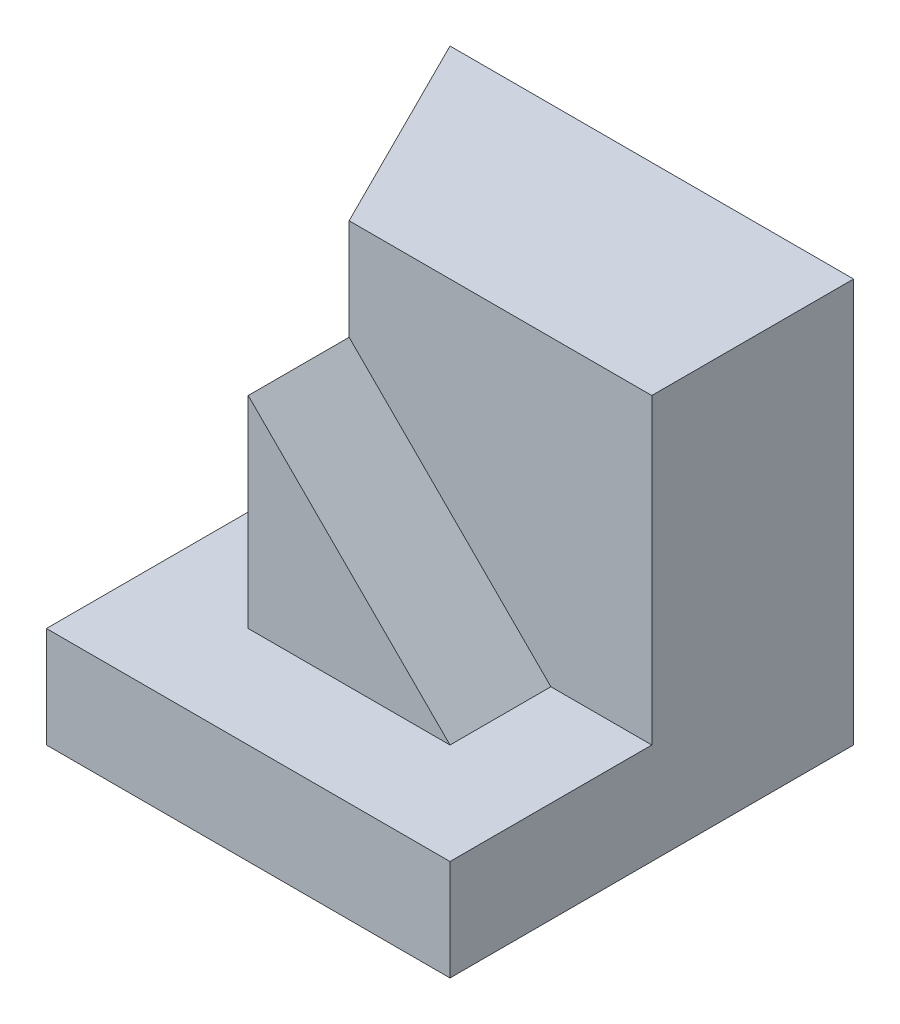
ISO-10303-21;
HEADER;
FILE_DESCRIPTION(('STEP AP214'),'2;1');
FILE_NAME('part.step','',(''),(''),'','','');
FILE_SCHEMA(('AUTOMOTIVE_DESIGN { 1 0 10303 214 1 1 1 1 }'));
ENDSEC;
DATA;
#1=APPLICATION_CONTEXT('core data for automotive mechanical design processes');
#2=APPLICATION_PROTOCOL_DEFINITION('international standard','automotive_design',2000,#1);
#3=PRODUCT_CONTEXT('',#1,'mechanical');
#4=PRODUCT('Part','Part','',(#3));
#5=PRODUCT_RELATED_PRODUCT_CATEGORY('part','',(#4));
#6=PRODUCT_DEFINITION_FORMATION('','',#4);
#7=PRODUCT_DEFINITION_CONTEXT('part definition',#1,'design');
#8=PRODUCT_DEFINITION('design','',#6,#7);
#9=PRODUCT_DEFINITION_SHAPE('','',#8);
#10=(LENGTH_UNIT() NAMED_UNIT(*) SI_UNIT(.MILLI.,.METRE.));
#11=(NAMED_UNIT(*) PLANE_ANGLE_UNIT() SI_UNIT($,.RADIAN.));
#12=(NAMED_UNIT(*) SI_UNIT($,.STERADIAN.) SOLID_ANGLE_UNIT());
#13=UNCERTAINTY_MEASURE_WITH_UNIT(LENGTH_MEASURE(1.E-05),#10,'distance_accuracy_value','');
#14=(GEOMETRIC_REPRESENTATION_CONTEXT(3) GLOBAL_UNCERTAINTY_ASSIGNED_CONTEXT((#13)) GLOBAL_UNIT_ASSIGNED_CONTEXT((#10,
#11,#12)) REPRESENTATION_CONTEXT('',''));
#15=CARTESIAN_POINT('',(0.,0.,0.));
#16=DIRECTION('',(0.,0.,1.));
#17=DIRECTION('',(1.,0.,0.));
#18=AXIS2_PLACEMENT_3D('',#15,#16,#17);
#19=CARTESIAN_POINT('',(0.,0.,40.));
#20=DIRECTION('',(1.,0.,0.));
#21=DIRECTION('',(0.,0.,-1.));
#22=AXIS2_PLACEMENT_3D('',#19,#20,#21);
#23=PLANE('',#22);
#24=DIRECTION('',(0.,0.,-1.));
#25=VECTOR('',#24,1.);
#26=CARTESIAN_POINT('',(0.,9.99999999999998,0.));
#27=LINE('',#26,#25);
#28=CARTESIAN_POINT('',(0.,10.,40.));
#29=VERTEX_POINT('',#28);
#30=CARTESIAN_POINT('',(0.,10.,0.));
#31=VERTEX_POINT('',#30);
#32=EDGE_CURVE('E47',#29,#31,#27,.T.);
#33=ORIENTED_EDGE('',*,*,#32,.T.);
#34=DIRECTION('',(0.,-1.,0.));
#35=VECTOR('',#34,1.);
#36=CARTESIAN_POINT('',(0.,0.,0.));
#37=LINE('',#36,#35);
#38=CARTESIAN_POINT('',(0.,0.,0.));
#39=VERTEX_POINT('',#38);
#40=EDGE_CURVE('E107',#31,#39,#37,.T.);
#41=ORIENTED_EDGE('',*,*,#40,.T.);
#42=DIRECTION('',(0.,0.,-1.));
#43=VECTOR('',#42,1.);
#44=CARTESIAN_POINT('',(0.,0.,40.));
#45=LINE('',#44,#43);
#46=CARTESIAN_POINT('',(0.,0.,40.));
#47=VERTEX_POINT('',#46);
#48=EDGE_CURVE('E11',#47,#39,#45,.T.);
#49=ORIENTED_EDGE('',*,*,#48,.F.);
#50=DIRECTION('',(0.,-1.,0.));
#51=VECTOR('',#50,1.);
#52=CARTESIAN_POINT('',(0.,0.,40.));
#53=LINE('',#52,#51);
#54=EDGE_CURVE('E101',#29,#47,#53,.T.);
#55=ORIENTED_EDGE('',*,*,#54,.F.);
#56=EDGE_LOOP('',(#33,#41,#49,#55));
#57=FACE_BOUND('',#56,.T.);
#58=ADVANCED_FACE('F33',(#57),#23,.F.);
#59=CARTESIAN_POINT('',(40.,0.,40.));
#60=DIRECTION('',(-1.,0.,0.));
#61=DIRECTION('',(0.,0.,1.));
#62=AXIS2_PLACEMENT_3D('',#59,#60,#61);
#63=PLANE('',#62);
#64=DIRECTION('',(0.,-1.,0.));
#65=VECTOR('',#64,1.);
#66=CARTESIAN_POINT('',(40.,0.,20.));
#67=LINE('',#66,#65);
#68=CARTESIAN_POINT('',(40.,40.,20.));
#69=VERTEX_POINT('',#68);
#70=CARTESIAN_POINT('',(40.,9.99999999999998,20.));
#71=VERTEX_POINT('',#70);
#72=EDGE_CURVE('E118',#69,#71,#67,.T.);
#73=ORIENTED_EDGE('',*,*,#72,.T.);
#74=DIRECTION('',(0.,0.,-1.));
#75=VECTOR('',#74,1.);
#76=CARTESIAN_POINT('',(40.,9.99999999999998,0.));
#77=LINE('',#76,#75);
#78=CARTESIAN_POINT('',(40.,10.,40.));
#79=VERTEX_POINT('',#78);
#80=EDGE_CURVE('E112',#79,#71,#77,.T.);
#81=ORIENTED_EDGE('',*,*,#80,.F.);
#82=DIRECTION('',(0.,1.,0.));
#83=VECTOR('',#82,1.);
#84=CARTESIAN_POINT('',(40.,0.,40.));
#85=LINE('',#84,#83);
#86=CARTESIAN_POINT('',(40.,0.,40.));
#87=VERTEX_POINT('',#86);
#88=EDGE_CURVE('E86',#87,#79,#85,.T.);
#89=ORIENTED_EDGE('',*,*,#88,.F.);
#90=DIRECTION('',(0.,0.,-1.));
#91=VECTOR('',#90,1.);
#92=CARTESIAN_POINT('',(40.,0.,40.));
#93=LINE('',#92,#91);
#94=CARTESIAN_POINT('',(40.,0.,0.));
#95=VERTEX_POINT('',#94);
#96=EDGE_CURVE('E40',#87,#95,#93,.T.);
#97=ORIENTED_EDGE('',*,*,#96,.T.);
#98=DIRECTION('',(0.,1.,0.));
#99=VECTOR('',#98,1.);
#100=CARTESIAN_POINT('',(40.,0.,0.));
#101=LINE('',#100,#99);
#102=CARTESIAN_POINT('',(40.,40.,0.));
#103=VERTEX_POINT('',#102);
#104=EDGE_CURVE('E90',#95,#103,#101,.T.);
#105=ORIENTED_EDGE('',*,*,#104,.T.);
#106=DIRECTION('',(0.,0.,-1.));
#107=VECTOR('',#106,1.);
#108=CARTESIAN_POINT('',(40.,40.,40.));
#109=LINE('',#108,#107);
#110=EDGE_CURVE('E73',#69,#103,#109,.T.);
#111=ORIENTED_EDGE('',*,*,#110,.F.);
#112=EDGE_LOOP('',(#73,#81,#89,#97,#105,#111));
#113=FACE_BOUND('',#112,.T.);
#114=ADVANCED_FACE('F91',(#113),#63,.F.);
#115=CARTESIAN_POINT('',(0.,0.,40.));
#116=DIRECTION('',(0.,0.,-1.));
#117=DIRECTION('',(-1.,0.,0.));
#118=AXIS2_PLACEMENT_3D('',#115,#116,#117);
#119=PLANE('',#118);
#120=DIRECTION('',(-1.,0.,0.));
#121=VECTOR('',#120,1.);
#122=CARTESIAN_POINT('',(40.,10.,40.));
#123=LINE('',#122,#121);
#124=EDGE_CURVE('E115',#79,#29,#123,.T.);
#125=ORIENTED_EDGE('',*,*,#124,.T.);
#126=ORIENTED_EDGE('',*,*,#54,.T.);
#127=DIRECTION('',(1.,0.,0.));
#128=VECTOR('',#127,1.);
#129=CARTESIAN_POINT('',(0.,0.,40.));
#130=LINE('',#129,#128);
#131=EDGE_CURVE('E56',#47,#87,#130,.T.);
#132=ORIENTED_EDGE('',*,*,#131,.T.);
#133=ORIENTED_EDGE('',*,*,#88,.T.);
#134=EDGE_LOOP('',(#125,#126,#132,#133));
#135=FACE_BOUND('',#134,.T.);
#136=ADVANCED_FACE('F212',(#135),#119,.F.);
#137=CARTESIAN_POINT('',(0.,0.,40.));
#138=DIRECTION('',(0.,1.,0.));
#139=DIRECTION('',(0.,0.,1.));
#140=AXIS2_PLACEMENT_3D('',#137,#138,#139);
#141=PLANE('',#140);
#142=DIRECTION('',(1.,0.,0.));
#143=VECTOR('',#142,1.);
#144=CARTESIAN_POINT('',(0.,0.,0.));
#145=LINE('',#144,#143);
#146=EDGE_CURVE('E95',#39,#95,#145,.T.);
#147=ORIENTED_EDGE('',*,*,#146,.T.);
#148=ORIENTED_EDGE('',*,*,#96,.F.);
#149=ORIENTED_EDGE('',*,*,#131,.F.);
#150=ORIENTED_EDGE('',*,*,#48,.T.);
#151=EDGE_LOOP('',(#147,#148,#149,#150));
#152=FACE_BOUND('',#151,.T.);
#153=ADVANCED_FACE('F217',(#152),#141,.F.);
#154=CARTESIAN_POINT('',(0.,40.,40.));
#155=DIRECTION('',(0.,-1.,0.));
#156=DIRECTION('',(0.,0.,-1.));
#157=AXIS2_PLACEMENT_3D('',#154,#155,#156);
#158=PLANE('',#157);
#159=DIRECTION('',(-1.,0.,0.));
#160=VECTOR('',#159,1.);
#161=CARTESIAN_POINT('',(0.,40.,0.));
#162=LINE('',#161,#160);
#163=CARTESIAN_POINT('',(0.,40.,0.));
#164=VERTEX_POINT('',#163);
#165=EDGE_CURVE('E79',#103,#164,#162,.T.);
#166=ORIENTED_EDGE('',*,*,#165,.T.);
#167=DIRECTION('',(-0.447213595499958,0.,-0.894427190999916));
#168=VECTOR('',#167,1.);
#169=CARTESIAN_POINT('',(10.,40.,20.));
#170=LINE('',#169,#168);
#171=CARTESIAN_POINT('',(10.,40.,20.));
#172=VERTEX_POINT('',#171);
#173=EDGE_CURVE('E144',#172,#164,#170,.T.);
#174=ORIENTED_EDGE('',*,*,#173,.F.);
#175=DIRECTION('',(-1.,0.,0.));
#176=VECTOR('',#175,1.);
#177=CARTESIAN_POINT('',(40.,40.,20.));
#178=LINE('',#177,#176);
#179=EDGE_CURVE('E83',#69,#172,#178,.T.);
#180=ORIENTED_EDGE('',*,*,#179,.F.);
#181=ORIENTED_EDGE('',*,*,#110,.T.);
#182=EDGE_LOOP('',(#166,#174,#180,#181));
#183=FACE_BOUND('',#182,.T.);
#184=ADVANCED_FACE('F75',(#183),#158,.F.);
#185=CARTESIAN_POINT('',(0.,0.,0.));
#186=DIRECTION('',(0.,0.,-1.));
#187=DIRECTION('',(-1.,0.,0.));
#188=AXIS2_PLACEMENT_3D('',#185,#186,#187);
#189=PLANE('',#188);
#190=EDGE_CURVE('E100',#164,#31,#37,.T.);
#191=ORIENTED_EDGE('',*,*,#190,.F.);
#192=ORIENTED_EDGE('',*,*,#165,.F.);
#193=ORIENTED_EDGE('',*,*,#104,.F.);
#194=ORIENTED_EDGE('',*,*,#146,.F.);
#195=ORIENTED_EDGE('',*,*,#40,.F.);
#196=EDGE_LOOP('',(#191,#192,#193,#194,#195));
#197=FACE_BOUND('',#196,.T.);
#198=ADVANCED_FACE('F97',(#197),#189,.T.);
#199=CARTESIAN_POINT('',(40.,9.99999999999998,0.));
#200=DIRECTION('',(0.,1.,0.));
#201=DIRECTION('',(0.,0.,1.));
#202=AXIS2_PLACEMENT_3D('',#199,#200,#201);
#203=PLANE('',#202);
#204=ORIENTED_EDGE('',*,*,#32,.F.);
#205=ORIENTED_EDGE('',*,*,#124,.F.);
#206=ORIENTED_EDGE('',*,*,#80,.T.);
#207=DIRECTION('',(-1.,0.,0.));
#208=VECTOR('',#207,1.);
#209=CARTESIAN_POINT('',(40.,9.99999999999998,20.));
#210=LINE('',#209,#208);
#211=CARTESIAN_POINT('',(30.,9.99999999999998,20.));
#212=VERTEX_POINT('',#211);
#213=EDGE_CURVE('E125',#71,#212,#210,.T.);
#214=ORIENTED_EDGE('',*,*,#213,.T.);
#215=DIRECTION('',(0.,0.,1.));
#216=VECTOR('',#215,1.);
#217=CARTESIAN_POINT('',(30.,9.99999999999998,20.));
#218=LINE('',#217,#216);
#219=CARTESIAN_POINT('',(30.,9.99999999999998,30.));
#220=VERTEX_POINT('',#219);
#221=EDGE_CURVE('E119',#212,#220,#218,.T.);
#222=ORIENTED_EDGE('',*,*,#221,.T.);
#223=DIRECTION('',(-1.,0.,0.));
#224=VECTOR('',#223,1.);
#225=CARTESIAN_POINT('',(40.,10.,30.));
#226=LINE('',#225,#224);
#227=CARTESIAN_POINT('',(10.,9.99999999999998,30.));
#228=VERTEX_POINT('',#227);
#229=EDGE_CURVE('E111',#220,#228,#226,.T.);
#230=ORIENTED_EDGE('',*,*,#229,.T.);
#231=DIRECTION('',(0.,0.,-1.));
#232=VECTOR('',#231,1.);
#233=CARTESIAN_POINT('',(10.,9.99999999999998,30.));
#234=LINE('',#233,#232);
#235=CARTESIAN_POINT('',(10.,9.99999999999998,20.));
#236=VERTEX_POINT('',#235);
#237=EDGE_CURVE('E132',#228,#236,#234,.T.);
#238=ORIENTED_EDGE('',*,*,#237,.T.);
#239=DIRECTION('',(-0.447213595499958,0.,-0.894427190999916));
#240=VECTOR('',#239,1.);
#241=CARTESIAN_POINT('',(10.,10.,20.));
#242=LINE('',#241,#240);
#243=EDGE_CURVE('E143',#236,#31,#242,.T.);
#244=ORIENTED_EDGE('',*,*,#243,.T.);
#245=EDGE_LOOP('',(#204,#205,#206,#214,#222,#230,#238,#244));
#246=FACE_BOUND('',#245,.T.);
#247=ADVANCED_FACE('F168',(#246),#203,.T.);
#248=CARTESIAN_POINT('',(40.,0.,30.));
#249=DIRECTION('',(0.,0.,-1.));
#250=DIRECTION('',(0.,1.,0.));
#251=AXIS2_PLACEMENT_3D('',#248,#249,#250);
#252=PLANE('',#251);
#253=ORIENTED_EDGE('',*,*,#229,.F.);
#254=DIRECTION('',(0.707106781186547,-0.707106781186548,0.));
#255=VECTOR('',#254,1.);
#256=CARTESIAN_POINT('',(10.,30.,30.));
#257=LINE('',#256,#255);
#258=CARTESIAN_POINT('',(10.,30.,30.));
#259=VERTEX_POINT('',#258);
#260=EDGE_CURVE('E149',#259,#220,#257,.T.);
#261=ORIENTED_EDGE('',*,*,#260,.F.);
#262=DIRECTION('',(0.,1.,0.));
#263=VECTOR('',#262,1.);
#264=CARTESIAN_POINT('',(10.,9.99999999999998,30.));
#265=LINE('',#264,#263);
#266=EDGE_CURVE('E129',#228,#259,#265,.T.);
#267=ORIENTED_EDGE('',*,*,#266,.F.);
#268=EDGE_LOOP('',(#253,#261,#267));
#269=FACE_BOUND('',#268,.T.);
#270=ADVANCED_FACE('F193',(#269),#252,.F.);
#271=CARTESIAN_POINT('',(40.,0.,20.));
#272=DIRECTION('',(0.,0.,-1.));
#273=DIRECTION('',(0.,1.,0.));
#274=AXIS2_PLACEMENT_3D('',#271,#272,#273);
#275=PLANE('',#274);
#276=DIRECTION('',(0.,1.,0.));
#277=VECTOR('',#276,1.);
#278=CARTESIAN_POINT('',(10.,10.,20.));
#279=LINE('',#278,#277);
#280=CARTESIAN_POINT('',(10.,30.,20.));
#281=VERTEX_POINT('',#280);
#282=EDGE_CURVE('E138',#281,#172,#279,.T.);
#283=ORIENTED_EDGE('',*,*,#282,.F.);
#284=DIRECTION('',(0.707106781186547,-0.707106781186548,0.));
#285=VECTOR('',#284,1.);
#286=CARTESIAN_POINT('',(10.,30.,20.));
#287=LINE('',#286,#285);
#288=EDGE_CURVE('E147',#281,#212,#287,.T.);
#289=ORIENTED_EDGE('',*,*,#288,.T.);
#290=ORIENTED_EDGE('',*,*,#213,.F.);
#291=ORIENTED_EDGE('',*,*,#72,.F.);
#292=ORIENTED_EDGE('',*,*,#179,.T.);
#293=EDGE_LOOP('',(#283,#289,#290,#291,#292));
#294=FACE_BOUND('',#293,.T.);
#295=ADVANCED_FACE('F158',(#294),#275,.F.);
#296=CARTESIAN_POINT('',(10.,9.99999999999998,30.));
#297=DIRECTION('',(1.,0.,0.));
#298=DIRECTION('',(0.,0.,-1.));
#299=AXIS2_PLACEMENT_3D('',#296,#297,#298);
#300=PLANE('',#299);
#301=DIRECTION('',(0.,0.,-1.));
#302=VECTOR('',#301,1.);
#303=CARTESIAN_POINT('',(10.,30.,30.));
#304=LINE('',#303,#302);
#305=EDGE_CURVE('E135',#259,#281,#304,.T.);
#306=ORIENTED_EDGE('',*,*,#305,.T.);
#307=DIRECTION('',(0.,1.,0.));
#308=VECTOR('',#307,1.);
#309=CARTESIAN_POINT('',(10.,9.99999999999998,20.));
#310=LINE('',#309,#308);
#311=EDGE_CURVE('E128',#236,#281,#310,.T.);
#312=ORIENTED_EDGE('',*,*,#311,.F.);
#313=ORIENTED_EDGE('',*,*,#237,.F.);
#314=ORIENTED_EDGE('',*,*,#266,.T.);
#315=EDGE_LOOP('',(#306,#312,#313,#314));
#316=FACE_BOUND('',#315,.T.);
#317=ADVANCED_FACE('F194',(#316),#300,.F.);
#318=CARTESIAN_POINT('',(10.,10.,20.));
#319=DIRECTION('',(0.894427190999916,0.,-0.447213595499958));
#320=DIRECTION('',(-0.447213595499958,0.,-0.894427190999916));
#321=AXIS2_PLACEMENT_3D('',#318,#319,#320);
#322=PLANE('',#321);
#323=ORIENTED_EDGE('',*,*,#173,.T.);
#324=ORIENTED_EDGE('',*,*,#190,.T.);
#325=ORIENTED_EDGE('',*,*,#243,.F.);
#326=ORIENTED_EDGE('',*,*,#311,.T.);
#327=ORIENTED_EDGE('',*,*,#282,.T.);
#328=EDGE_LOOP('',(#323,#324,#325,#326,#327));
#329=FACE_BOUND('',#328,.T.);
#330=ADVANCED_FACE('F199',(#329),#322,.F.);
#331=CARTESIAN_POINT('',(10.,30.,20.));
#332=DIRECTION('',(-0.707106781186548,-0.707106781186547,0.));
#333=DIRECTION('',(0.707106781186547,-0.707106781186548,0.));
#334=AXIS2_PLACEMENT_3D('',#331,#332,#333);
#335=PLANE('',#334);
#336=ORIENTED_EDGE('',*,*,#260,.T.);
#337=ORIENTED_EDGE('',*,*,#221,.F.);
#338=ORIENTED_EDGE('',*,*,#288,.F.);
#339=ORIENTED_EDGE('',*,*,#305,.F.);
#340=EDGE_LOOP('',(#336,#337,#338,#339));
#341=FACE_BOUND('',#340,.T.);
#342=ADVANCED_FACE('F188',(#341),#335,.F.);
#343=CLOSED_SHELL('',(#58,#114,#136,#153,#184,#198,#247,#270,#295,#317,#330,#342));
#344=MANIFOLD_SOLID_BREP('B2',#343);
#345=ADVANCED_BREP_SHAPE_REPRESENTATION('',(#18,#344),#14);
#346=SHAPE_DEFINITION_REPRESENTATION(#9,#345);
ENDSEC;
END-ISO-10303-21;
